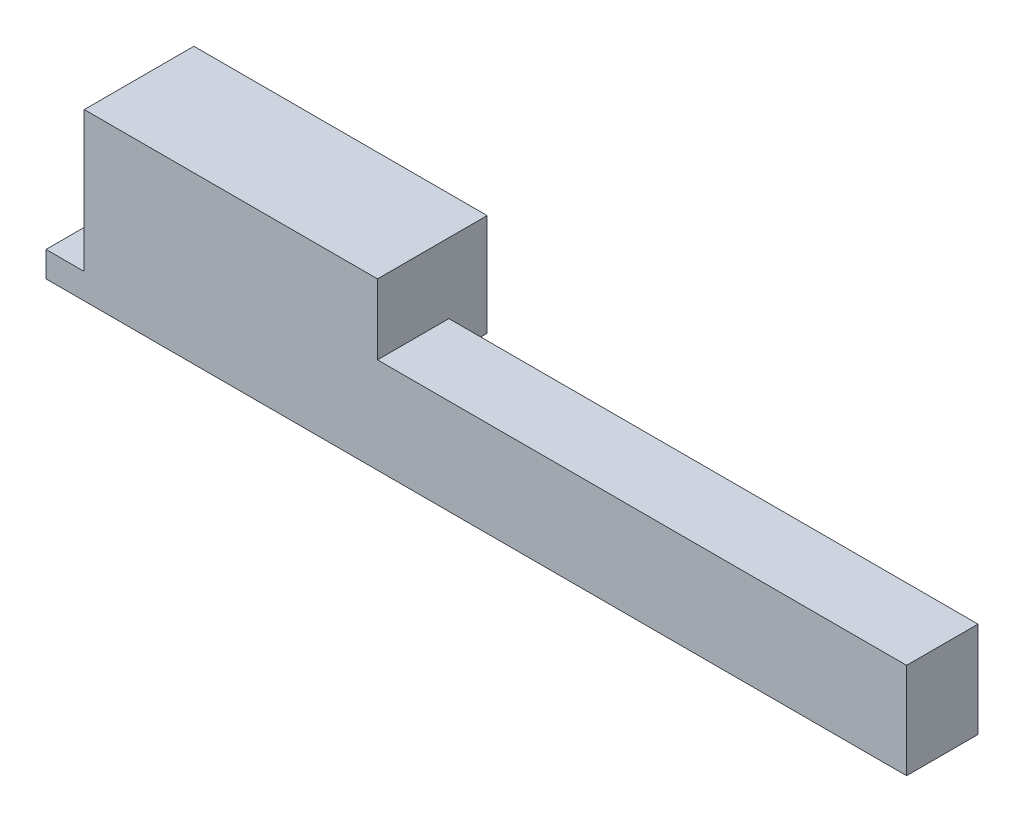
ISO-10303-21;
HEADER;
FILE_DESCRIPTION(('STEP AP214'),'2;1');
FILE_NAME('part.step','',(''),(''),'','','');
FILE_SCHEMA(('AUTOMOTIVE_DESIGN { 1 0 10303 214 1 1 1 1 }'));
ENDSEC;
DATA;
#1=APPLICATION_CONTEXT('core data for automotive mechanical design processes');
#2=APPLICATION_PROTOCOL_DEFINITION('international standard','automotive_design',2000,#1);
#3=PRODUCT_CONTEXT('',#1,'mechanical');
#4=PRODUCT('Part','Part','',(#3));
#5=PRODUCT_RELATED_PRODUCT_CATEGORY('part','',(#4));
#6=PRODUCT_DEFINITION_FORMATION('','',#4);
#7=PRODUCT_DEFINITION_CONTEXT('part definition',#1,'design');
#8=PRODUCT_DEFINITION('design','',#6,#7);
#9=PRODUCT_DEFINITION_SHAPE('','',#8);
#10=(LENGTH_UNIT() NAMED_UNIT(*) SI_UNIT(.MILLI.,.METRE.));
#11=(NAMED_UNIT(*) PLANE_ANGLE_UNIT() SI_UNIT($,.RADIAN.));
#12=(NAMED_UNIT(*) SI_UNIT($,.STERADIAN.) SOLID_ANGLE_UNIT());
#13=UNCERTAINTY_MEASURE_WITH_UNIT(LENGTH_MEASURE(1.E-05),#10,'distance_accuracy_value','');
#14=(GEOMETRIC_REPRESENTATION_CONTEXT(3) GLOBAL_UNCERTAINTY_ASSIGNED_CONTEXT((#13)) GLOBAL_UNIT_ASSIGNED_CONTEXT((#10,
#11,#12)) REPRESENTATION_CONTEXT('',''));
#15=CARTESIAN_POINT('',(0.,0.,0.));
#16=DIRECTION('',(0.,0.,1.));
#17=DIRECTION('',(1.,0.,0.));
#18=AXIS2_PLACEMENT_3D('',#15,#16,#17);
#19=CARTESIAN_POINT('',(-68.1667325538345,0.,0.));
#20=DIRECTION('',(-1.,0.,0.));
#21=DIRECTION('',(0.,0.,1.));
#22=AXIS2_PLACEMENT_3D('',#19,#20,#21);
#23=PLANE('',#22);
#24=DIRECTION('',(0.,0.,-1.));
#25=VECTOR('',#24,1.);
#26=CARTESIAN_POINT('',(-68.1667325538346,186.102166940836,4.33149354715814));
#27=LINE('',#26,#25);
#28=CARTESIAN_POINT('',(-68.1667325538346,186.102166940836,13.6648268804915));
#29=VERTEX_POINT('',#28);
#30=CARTESIAN_POINT('',(-68.1667325538346,186.102166940836,4.33149354715814));
#31=VERTEX_POINT('',#30);
#32=EDGE_CURVE('E54',#29,#31,#27,.T.);
#33=ORIENTED_EDGE('',*,*,#32,.F.);
#34=DIRECTION('',(0.,1.,0.));
#35=VECTOR('',#34,1.);
#36=CARTESIAN_POINT('',(-68.1667325538346,-43.0644997258311,13.6648268804915));
#37=LINE('',#36,#35);
#38=CARTESIAN_POINT('',(-68.1667325538346,173.602166940836,13.6648268804915));
#39=VERTEX_POINT('',#38);
#40=EDGE_CURVE('E211',#39,#29,#37,.T.);
#41=ORIENTED_EDGE('',*,*,#40,.F.);
#42=DIRECTION('',(0.,0.,1.));
#43=VECTOR('',#42,1.);
#44=CARTESIAN_POINT('',(-68.1667325538345,173.602166940836,0.));
#45=LINE('',#44,#43);
#46=CARTESIAN_POINT('',(-68.1667325538346,173.602166940836,4.33149354715814));
#47=VERTEX_POINT('',#46);
#48=EDGE_CURVE('E11',#47,#39,#45,.T.);
#49=ORIENTED_EDGE('',*,*,#48,.F.);
#50=DIRECTION('',(0.,-1.,0.));
#51=VECTOR('',#50,1.);
#52=CARTESIAN_POINT('',(-68.1667325538346,-43.0644997258311,4.33149354715814));
#53=LINE('',#52,#51);
#54=EDGE_CURVE('E49',#31,#47,#53,.T.);
#55=ORIENTED_EDGE('',*,*,#54,.F.);
#56=EDGE_LOOP('',(#33,#41,#49,#55));
#57=FACE_BOUND('',#56,.T.);
#58=ADVANCED_FACE('F46',(#57),#23,.F.);
#59=CARTESIAN_POINT('',(-67.7500658871679,-43.0644997258313,-0.668506452841859));
#60=DIRECTION('',(0.,0.,1.));
#61=DIRECTION('',(0.,-1.,0.));
#62=AXIS2_PLACEMENT_3D('',#59,#60,#61);
#63=PLANE('',#62);
#64=DIRECTION('',(-1.,0.,0.));
#65=VECTOR('',#64,1.);
#66=CARTESIAN_POINT('',(-67.7500658871679,181.935500274169,-0.668506452841859));
#67=LINE('',#66,#65);
#68=CARTESIAN_POINT('',(-137.333399220501,181.935500274169,-0.668506452841859));
#69=VERTEX_POINT('',#68);
#70=CARTESIAN_POINT('',(-173.746119425869,181.935500274169,-0.668506452841859));
#71=VERTEX_POINT('',#70);
#72=EDGE_CURVE('E190',#69,#71,#67,.T.);
#73=ORIENTED_EDGE('',*,*,#72,.T.);
#74=DIRECTION('',(-0.692646888854002,-0.721276845157858,0.));
#75=VECTOR('',#74,1.);
#76=CARTESIAN_POINT('',(-173.746119425869,181.935500274169,-0.668506452841859));
#77=LINE('',#76,#75);
#78=CARTESIAN_POINT('',(-175.666732553835,179.935500274169,-0.668506452841859));
#79=VERTEX_POINT('',#78);
#80=EDGE_CURVE('E238',#71,#79,#77,.T.);
#81=ORIENTED_EDGE('',*,*,#80,.T.);
#82=DIRECTION('',(0.,-1.,0.));
#83=VECTOR('',#82,1.);
#84=CARTESIAN_POINT('',(-175.666732553835,-43.0644997258311,-0.668506452841859));
#85=LINE('',#84,#83);
#86=CARTESIAN_POINT('',(-175.666732553835,195.268833607502,-0.668506452841859));
#87=VERTEX_POINT('',#86);
#88=EDGE_CURVE('E233',#87,#79,#85,.T.);
#89=ORIENTED_EDGE('',*,*,#88,.F.);
#90=DIRECTION('',(-1.,0.,0.));
#91=VECTOR('',#90,1.);
#92=CARTESIAN_POINT('',(-67.7500658871679,195.268833607502,-0.668506452841859));
#93=LINE('',#92,#91);
#94=CARTESIAN_POINT('',(-137.333399220501,195.268833607502,-0.668506452841859));
#95=VERTEX_POINT('',#94);
#96=EDGE_CURVE('E239',#95,#87,#93,.T.);
#97=ORIENTED_EDGE('',*,*,#96,.F.);
#98=DIRECTION('',(0.,1.,0.));
#99=VECTOR('',#98,1.);
#100=CARTESIAN_POINT('',(-137.333399220501,-43.0644997258313,-0.668506452841859));
#101=LINE('',#100,#99);
#102=EDGE_CURVE('E166',#69,#95,#101,.T.);
#103=ORIENTED_EDGE('',*,*,#102,.F.);
#104=EDGE_LOOP('',(#73,#81,#89,#97,#103));
#105=FACE_BOUND('',#104,.T.);
#106=ADVANCED_FACE('F274',(#105),#63,.F.);
#107=CARTESIAN_POINT('',(-180.666732553835,-43.0644997258311,8.66482688049147));
#108=DIRECTION('',(0.,0.,-1.));
#109=DIRECTION('',(0.,-1.,0.));
#110=AXIS2_PLACEMENT_3D('',#107,#108,#109);
#111=PLANE('',#110);
#112=DIRECTION('',(1.,0.,0.));
#113=VECTOR('',#112,1.);
#114=CARTESIAN_POINT('',(-180.666732553835,173.602166940836,8.66482688049147));
#115=LINE('',#114,#113);
#116=CARTESIAN_POINT('',(-180.666732553835,173.602166940836,8.66482688049147));
#117=VERTEX_POINT('',#116);
#118=CARTESIAN_POINT('',(-175.666732553835,173.602166940836,8.66482688049147));
#119=VERTEX_POINT('',#118);
#120=EDGE_CURVE('E212',#117,#119,#115,.T.);
#121=ORIENTED_EDGE('',*,*,#120,.F.);
#122=DIRECTION('',(0.,-1.,0.));
#123=VECTOR('',#122,1.);
#124=CARTESIAN_POINT('',(-180.666732553835,176.935500274169,8.66482688049147));
#125=LINE('',#124,#123);
#126=CARTESIAN_POINT('',(-180.666732553835,176.935500274169,8.66482688049147));
#127=VERTEX_POINT('',#126);
#128=EDGE_CURVE('E200',#127,#117,#125,.T.);
#129=ORIENTED_EDGE('',*,*,#128,.F.);
#130=DIRECTION('',(-1.,0.,0.));
#131=VECTOR('',#130,1.);
#132=CARTESIAN_POINT('',(-180.666732553835,176.935500274169,8.66482688049147));
#133=LINE('',#132,#131);
#134=CARTESIAN_POINT('',(-175.666732553835,176.935500274169,8.66482688049147));
#135=VERTEX_POINT('',#134);
#136=EDGE_CURVE('E196',#135,#127,#133,.T.);
#137=ORIENTED_EDGE('',*,*,#136,.F.);
#138=DIRECTION('',(0.,1.,0.));
#139=VECTOR('',#138,1.);
#140=CARTESIAN_POINT('',(-175.666732553835,176.935500274169,8.66482688049147));
#141=LINE('',#140,#139);
#142=EDGE_CURVE('E185',#119,#135,#141,.T.);
#143=ORIENTED_EDGE('',*,*,#142,.F.);
#144=EDGE_LOOP('',(#121,#129,#137,#143));
#145=FACE_BOUND('',#144,.T.);
#146=ADVANCED_FACE('F303',(#145),#111,.T.);
#147=CARTESIAN_POINT('',(-67.7500658871679,181.935500274169,4.33149354715814));
#148=DIRECTION('',(0.,-1.,0.));
#149=DIRECTION('',(-1.,0.,0.));
#150=AXIS2_PLACEMENT_3D('',#147,#148,#149);
#151=PLANE('',#150);
#152=ORIENTED_EDGE('',*,*,#72,.F.);
#153=DIRECTION('',(0.,0.,-1.));
#154=VECTOR('',#153,1.);
#155=CARTESIAN_POINT('',(-137.333399220501,181.935500274169,75.1807564618534));
#156=LINE('',#155,#154);
#157=CARTESIAN_POINT('',(-137.333399220501,181.935500274169,4.33149354715816));
#158=VERTEX_POINT('',#157);
#159=EDGE_CURVE('E194',#158,#69,#156,.T.);
#160=ORIENTED_EDGE('',*,*,#159,.F.);
#161=DIRECTION('',(-1.,0.,0.));
#162=VECTOR('',#161,1.);
#163=CARTESIAN_POINT('',(-67.7500658871679,181.935500274169,4.33149354715814));
#164=LINE('',#163,#162);
#165=CARTESIAN_POINT('',(-173.746119425869,181.935500274169,4.33149354715814));
#166=VERTEX_POINT('',#165);
#167=EDGE_CURVE('E172',#158,#166,#164,.T.);
#168=ORIENTED_EDGE('',*,*,#167,.T.);
#169=DIRECTION('',(0.,0.,1.));
#170=VECTOR('',#169,1.);
#171=CARTESIAN_POINT('',(-173.746119425869,181.935500274169,-3.44136685093544));
#172=LINE('',#171,#170);
#173=EDGE_CURVE('E254',#71,#166,#172,.T.);
#174=ORIENTED_EDGE('',*,*,#173,.F.);
#175=EDGE_LOOP('',(#152,#160,#168,#174));
#176=FACE_BOUND('',#175,.T.);
#177=ADVANCED_FACE('F321',(#176),#151,.T.);
#178=CARTESIAN_POINT('',(-173.746119425869,181.935500274169,-3.44136685093544));
#179=DIRECTION('',(-0.721276845157858,0.692646888854002,0.));
#180=DIRECTION('',(0.,0.,1.));
#181=AXIS2_PLACEMENT_3D('',#178,#179,#180);
#182=PLANE('',#181);
#183=ORIENTED_EDGE('',*,*,#173,.T.);
#184=DIRECTION('',(0.692646888854002,0.721276845157858,0.));
#185=VECTOR('',#184,1.);
#186=CARTESIAN_POINT('',(-173.746119425869,181.935500274169,4.33149354715814));
#187=LINE('',#186,#185);
#188=CARTESIAN_POINT('',(-175.666732553835,179.935500274169,4.33149354715814));
#189=VERTEX_POINT('',#188);
#190=EDGE_CURVE('E187',#189,#166,#187,.T.);
#191=ORIENTED_EDGE('',*,*,#190,.F.);
#192=DIRECTION('',(0.,0.,1.));
#193=VECTOR('',#192,1.);
#194=CARTESIAN_POINT('',(-175.666732553835,179.935500274169,-3.44136685093544));
#195=LINE('',#194,#193);
#196=EDGE_CURVE('E195',#79,#189,#195,.T.);
#197=ORIENTED_EDGE('',*,*,#196,.F.);
#198=ORIENTED_EDGE('',*,*,#80,.F.);
#199=EDGE_LOOP('',(#183,#191,#197,#198));
#200=FACE_BOUND('',#199,.T.);
#201=ADVANCED_FACE('F293',(#200),#182,.F.);
#202=CARTESIAN_POINT('',(-180.666732553835,-43.0644997258311,12.6648268804915));
#203=DIRECTION('',(1.,0.,0.));
#204=DIRECTION('',(0.,1.,0.));
#205=AXIS2_PLACEMENT_3D('',#202,#203,#204);
#206=PLANE('',#205);
#207=ORIENTED_EDGE('',*,*,#128,.T.);
#208=DIRECTION('',(0.,0.,1.));
#209=VECTOR('',#208,1.);
#210=CARTESIAN_POINT('',(-180.666732553835,173.602166940836,12.6648268804915));
#211=LINE('',#210,#209);
#212=CARTESIAN_POINT('',(-180.666732553835,173.602166940836,13.6648268804915));
#213=VERTEX_POINT('',#212);
#214=EDGE_CURVE('E207',#117,#213,#211,.T.);
#215=ORIENTED_EDGE('',*,*,#214,.T.);
#216=DIRECTION('',(0.,-1.,0.));
#217=VECTOR('',#216,1.);
#218=CARTESIAN_POINT('',(-180.666732553835,-33.0644997258311,13.6648268804915));
#219=LINE('',#218,#217);
#220=CARTESIAN_POINT('',(-180.666732553835,176.935500274169,13.6648268804915));
#221=VERTEX_POINT('',#220);
#222=EDGE_CURVE('E257',#221,#213,#219,.T.);
#223=ORIENTED_EDGE('',*,*,#222,.F.);
#224=DIRECTION('',(0.,0.,-1.));
#225=VECTOR('',#224,1.);
#226=CARTESIAN_POINT('',(-180.666732553835,176.935500274169,12.6648268804915));
#227=LINE('',#226,#225);
#228=EDGE_CURVE('E178',#221,#127,#227,.T.);
#229=ORIENTED_EDGE('',*,*,#228,.T.);
#230=EDGE_LOOP('',(#207,#215,#223,#229));
#231=FACE_BOUND('',#230,.T.);
#232=ADVANCED_FACE('F310',(#231),#206,.F.);
#233=CARTESIAN_POINT('',(-180.666732553835,176.935500274169,12.6648268804915));
#234=DIRECTION('',(0.,-1.,0.));
#235=DIRECTION('',(0.,0.,-1.));
#236=AXIS2_PLACEMENT_3D('',#233,#234,#235);
#237=PLANE('',#236);
#238=ORIENTED_EDGE('',*,*,#136,.T.);
#239=ORIENTED_EDGE('',*,*,#228,.F.);
#240=DIRECTION('',(-1.,0.,0.));
#241=VECTOR('',#240,1.);
#242=CARTESIAN_POINT('',(-180.666732553835,176.935500274169,13.6648268804915));
#243=LINE('',#242,#241);
#244=CARTESIAN_POINT('',(-175.666732553835,176.935500274169,13.6648268804915));
#245=VERTEX_POINT('',#244);
#246=EDGE_CURVE('E199',#245,#221,#243,.T.);
#247=ORIENTED_EDGE('',*,*,#246,.F.);
#248=DIRECTION('',(0.,0.,-1.));
#249=VECTOR('',#248,1.);
#250=CARTESIAN_POINT('',(-175.666732553835,176.935500274169,12.6648268804915));
#251=LINE('',#250,#249);
#252=EDGE_CURVE('E181',#245,#135,#251,.T.);
#253=ORIENTED_EDGE('',*,*,#252,.T.);
#254=EDGE_LOOP('',(#238,#239,#247,#253));
#255=FACE_BOUND('',#254,.T.);
#256=ADVANCED_FACE('F307',(#255),#237,.F.);
#257=CARTESIAN_POINT('',(-175.666732553835,-43.0644997258311,12.6648268804915));
#258=DIRECTION('',(-1.,0.,0.));
#259=DIRECTION('',(0.,0.,1.));
#260=AXIS2_PLACEMENT_3D('',#257,#258,#259);
#261=PLANE('',#260);
#262=DIRECTION('',(0.,0.,-1.));
#263=VECTOR('',#262,1.);
#264=CARTESIAN_POINT('',(-175.666732553834,173.602166940836,12.6648268804915));
#265=LINE('',#264,#263);
#266=CARTESIAN_POINT('',(-175.666732553834,173.602166940836,4.33149354715814));
#267=VERTEX_POINT('',#266);
#268=EDGE_CURVE('E208',#119,#267,#265,.T.);
#269=ORIENTED_EDGE('',*,*,#268,.F.);
#270=ORIENTED_EDGE('',*,*,#142,.T.);
#271=ORIENTED_EDGE('',*,*,#252,.F.);
#272=DIRECTION('',(0.,-1.,0.));
#273=VECTOR('',#272,1.);
#274=CARTESIAN_POINT('',(-175.666732553835,176.935500274169,13.6648268804915));
#275=LINE('',#274,#273);
#276=CARTESIAN_POINT('',(-175.666732553835,195.268833607502,13.6648268804915));
#277=VERTEX_POINT('',#276);
#278=EDGE_CURVE('E184',#277,#245,#275,.T.);
#279=ORIENTED_EDGE('',*,*,#278,.F.);
#280=DIRECTION('',(0.,0.,-1.));
#281=VECTOR('',#280,1.);
#282=CARTESIAN_POINT('',(-175.666732553835,195.268833607502,12.6648268804915));
#283=LINE('',#282,#281);
#284=EDGE_CURVE('E230',#277,#87,#283,.T.);
#285=ORIENTED_EDGE('',*,*,#284,.T.);
#286=ORIENTED_EDGE('',*,*,#88,.T.);
#287=ORIENTED_EDGE('',*,*,#196,.T.);
#288=DIRECTION('',(0.,-1.,0.));
#289=VECTOR('',#288,1.);
#290=CARTESIAN_POINT('',(-175.666732553835,-43.0644997258311,4.33149354715814));
#291=LINE('',#290,#289);
#292=EDGE_CURVE('E155',#189,#267,#291,.T.);
#293=ORIENTED_EDGE('',*,*,#292,.T.);
#294=EDGE_LOOP('',(#269,#270,#271,#279,#285,#286,#287,#293));
#295=FACE_BOUND('',#294,.T.);
#296=ADVANCED_FACE('F279',(#295),#261,.T.);
#297=CARTESIAN_POINT('',(-180.666732553835,195.268833607502,12.6648268804915));
#298=DIRECTION('',(0.,-1.,0.));
#299=DIRECTION('',(0.,0.,-1.));
#300=AXIS2_PLACEMENT_3D('',#297,#298,#299);
#301=PLANE('',#300);
#302=DIRECTION('',(0.,0.,-1.));
#303=VECTOR('',#302,1.);
#304=CARTESIAN_POINT('',(-137.333399220501,195.268833607502,75.1807564618534));
#305=LINE('',#304,#303);
#306=CARTESIAN_POINT('',(-137.333399220501,195.268833607502,13.6648268804915));
#307=VERTEX_POINT('',#306);
#308=EDGE_CURVE('E243',#307,#95,#305,.T.);
#309=ORIENTED_EDGE('',*,*,#308,.T.);
#310=ORIENTED_EDGE('',*,*,#96,.T.);
#311=ORIENTED_EDGE('',*,*,#284,.F.);
#312=DIRECTION('',(-1.,0.,0.));
#313=VECTOR('',#312,1.);
#314=CARTESIAN_POINT('',(-175.666732553835,195.268833607502,13.6648268804915));
#315=LINE('',#314,#313);
#316=EDGE_CURVE('E235',#307,#277,#315,.T.);
#317=ORIENTED_EDGE('',*,*,#316,.F.);
#318=EDGE_LOOP('',(#309,#310,#311,#317));
#319=FACE_BOUND('',#318,.T.);
#320=ADVANCED_FACE('F269',(#319),#301,.F.);
#321=CARTESIAN_POINT('',(-137.333399220501,-43.0644997258311,75.1807564618534));
#322=DIRECTION('',(-1.,0.,0.));
#323=DIRECTION('',(0.,0.,1.));
#324=AXIS2_PLACEMENT_3D('',#321,#322,#323);
#325=PLANE('',#324);
#326=DIRECTION('',(0.,0.,1.));
#327=VECTOR('',#326,1.);
#328=CARTESIAN_POINT('',(-137.333399220501,186.102166940836,13.6648268804915));
#329=LINE('',#328,#327);
#330=CARTESIAN_POINT('',(-137.333399220501,186.102166940836,4.33149354715814));
#331=VERTEX_POINT('',#330);
#332=CARTESIAN_POINT('',(-137.333399220501,186.102166940836,13.6648268804915));
#333=VERTEX_POINT('',#332);
#334=EDGE_CURVE('E153',#331,#333,#329,.T.);
#335=ORIENTED_EDGE('',*,*,#334,.F.);
#336=DIRECTION('',(0.,-1.,0.));
#337=VECTOR('',#336,1.);
#338=CARTESIAN_POINT('',(-137.333399220501,-43.0644997258311,4.33149354715814));
#339=LINE('',#338,#337);
#340=EDGE_CURVE('E156',#331,#158,#339,.T.);
#341=ORIENTED_EDGE('',*,*,#340,.T.);
#342=ORIENTED_EDGE('',*,*,#159,.T.);
#343=ORIENTED_EDGE('',*,*,#102,.T.);
#344=ORIENTED_EDGE('',*,*,#308,.F.);
#345=DIRECTION('',(0.,1.,0.));
#346=VECTOR('',#345,1.);
#347=CARTESIAN_POINT('',(-137.333399220501,195.268833607502,13.6648268804915));
#348=LINE('',#347,#346);
#349=EDGE_CURVE('E164',#333,#307,#348,.T.);
#350=ORIENTED_EDGE('',*,*,#349,.F.);
#351=EDGE_LOOP('',(#335,#341,#342,#343,#344,#350));
#352=FACE_BOUND('',#351,.T.);
#353=ADVANCED_FACE('F161',(#352),#325,.F.);
#354=CARTESIAN_POINT('',(45.1666007794988,186.102166940836,4.33149354715814));
#355=DIRECTION('',(0.,-1.,0.));
#356=DIRECTION('',(0.,0.,-1.));
#357=AXIS2_PLACEMENT_3D('',#354,#355,#356);
#358=PLANE('',#357);
#359=DIRECTION('',(1.,0.,0.));
#360=VECTOR('',#359,1.);
#361=CARTESIAN_POINT('',(-137.333399220501,186.102166940836,13.6648268804915));
#362=LINE('',#361,#360);
#363=EDGE_CURVE('E205',#333,#29,#362,.T.);
#364=ORIENTED_EDGE('',*,*,#363,.T.);
#365=ORIENTED_EDGE('',*,*,#32,.T.);
#366=DIRECTION('',(-1.,0.,0.));
#367=VECTOR('',#366,1.);
#368=CARTESIAN_POINT('',(-137.333399220501,186.102166940836,4.33149354715814));
#369=LINE('',#368,#367);
#370=EDGE_CURVE('E149',#31,#331,#369,.T.);
#371=ORIENTED_EDGE('',*,*,#370,.T.);
#372=ORIENTED_EDGE('',*,*,#334,.T.);
#373=EDGE_LOOP('',(#364,#365,#371,#372));
#374=FACE_BOUND('',#373,.T.);
#375=ADVANCED_FACE('F152',(#374),#358,.F.);
#376=CARTESIAN_POINT('',(0.,173.602166940836,0.));
#377=DIRECTION('',(0.,1.,0.));
#378=DIRECTION('',(0.,0.,1.));
#379=AXIS2_PLACEMENT_3D('',#376,#377,#378);
#380=PLANE('',#379);
#381=DIRECTION('',(-1.,0.,0.));
#382=VECTOR('',#381,1.);
#383=CARTESIAN_POINT('',(45.1666007794988,173.602166940836,4.33149354715814));
#384=LINE('',#383,#382);
#385=EDGE_CURVE('E204',#47,#267,#384,.T.);
#386=ORIENTED_EDGE('',*,*,#385,.F.);
#387=ORIENTED_EDGE('',*,*,#48,.T.);
#388=DIRECTION('',(1.,0.,0.));
#389=VECTOR('',#388,1.);
#390=CARTESIAN_POINT('',(45.1666007794988,173.602166940836,13.6648268804915));
#391=LINE('',#390,#389);
#392=EDGE_CURVE('E201',#213,#39,#391,.T.);
#393=ORIENTED_EDGE('',*,*,#392,.F.);
#394=ORIENTED_EDGE('',*,*,#214,.F.);
#395=ORIENTED_EDGE('',*,*,#120,.T.);
#396=ORIENTED_EDGE('',*,*,#268,.T.);
#397=EDGE_LOOP('',(#386,#387,#393,#394,#395,#396));
#398=FACE_BOUND('',#397,.T.);
#399=ADVANCED_FACE('F297',(#398),#380,.F.);
#400=CARTESIAN_POINT('',(45.1666007794988,-43.0644997258311,13.6648268804915));
#401=DIRECTION('',(0.,0.,-1.));
#402=DIRECTION('',(0.,-1.,0.));
#403=AXIS2_PLACEMENT_3D('',#400,#401,#402);
#404=PLANE('',#403);
#405=ORIENTED_EDGE('',*,*,#392,.T.);
#406=ORIENTED_EDGE('',*,*,#40,.T.);
#407=ORIENTED_EDGE('',*,*,#363,.F.);
#408=ORIENTED_EDGE('',*,*,#349,.T.);
#409=ORIENTED_EDGE('',*,*,#316,.T.);
#410=ORIENTED_EDGE('',*,*,#278,.T.);
#411=ORIENTED_EDGE('',*,*,#246,.T.);
#412=ORIENTED_EDGE('',*,*,#222,.T.);
#413=EDGE_LOOP('',(#405,#406,#407,#408,#409,#410,#411,#412));
#414=FACE_BOUND('',#413,.T.);
#415=ADVANCED_FACE('F219',(#414),#404,.F.);
#416=CARTESIAN_POINT('',(45.1666007794988,-43.0644997258311,4.33149354715814));
#417=DIRECTION('',(0.,0.,1.));
#418=DIRECTION('',(1.,0.,0.));
#419=AXIS2_PLACEMENT_3D('',#416,#417,#418);
#420=PLANE('',#419);
#421=ORIENTED_EDGE('',*,*,#370,.F.);
#422=ORIENTED_EDGE('',*,*,#54,.T.);
#423=ORIENTED_EDGE('',*,*,#385,.T.);
#424=ORIENTED_EDGE('',*,*,#292,.F.);
#425=ORIENTED_EDGE('',*,*,#190,.T.);
#426=ORIENTED_EDGE('',*,*,#167,.F.);
#427=ORIENTED_EDGE('',*,*,#340,.F.);
#428=EDGE_LOOP('',(#421,#422,#423,#424,#425,#426,#427));
#429=FACE_BOUND('',#428,.T.);
#430=ADVANCED_FACE('F169',(#429),#420,.F.);
#431=CLOSED_SHELL('',(#58,#106,#146,#177,#201,#232,#256,#296,#320,#353,#375,#399,#415,#430));
#432=MANIFOLD_SOLID_BREP('B2',#431);
#433=ADVANCED_BREP_SHAPE_REPRESENTATION('',(#18,#432),#14);
#434=SHAPE_DEFINITION_REPRESENTATION(#9,#433);
ENDSEC;
END-ISO-10303-21;
